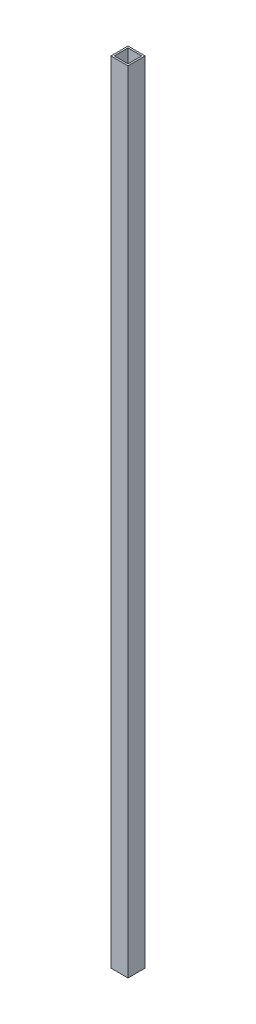
ISO-10303-21;
HEADER;
FILE_DESCRIPTION(('STEP AP214'),'2;1');
FILE_NAME('part.step','',(''),(''),'','','');
FILE_SCHEMA(('AUTOMOTIVE_DESIGN { 1 0 10303 214 1 1 1 1 }'));
ENDSEC;
DATA;
#1=APPLICATION_CONTEXT('core data for automotive mechanical design processes');
#2=APPLICATION_PROTOCOL_DEFINITION('international standard','automotive_design',2000,#1);
#3=PRODUCT_CONTEXT('',#1,'mechanical');
#4=PRODUCT('Part','Part','',(#3));
#5=PRODUCT_RELATED_PRODUCT_CATEGORY('part','',(#4));
#6=PRODUCT_DEFINITION_FORMATION('','',#4);
#7=PRODUCT_DEFINITION_CONTEXT('part definition',#1,'design');
#8=PRODUCT_DEFINITION('design','',#6,#7);
#9=PRODUCT_DEFINITION_SHAPE('','',#8);
#10=(LENGTH_UNIT() NAMED_UNIT(*) SI_UNIT(.MILLI.,.METRE.));
#11=(NAMED_UNIT(*) PLANE_ANGLE_UNIT() SI_UNIT($,.RADIAN.));
#12=(NAMED_UNIT(*) SI_UNIT($,.STERADIAN.) SOLID_ANGLE_UNIT());
#13=UNCERTAINTY_MEASURE_WITH_UNIT(LENGTH_MEASURE(1.E-05),#10,'distance_accuracy_value','');
#14=(GEOMETRIC_REPRESENTATION_CONTEXT(3) GLOBAL_UNCERTAINTY_ASSIGNED_CONTEXT((#13)) GLOBAL_UNIT_ASSIGNED_CONTEXT((#10,
#11,#12)) REPRESENTATION_CONTEXT('',''));
#15=CARTESIAN_POINT('',(0.,0.,0.));
#16=DIRECTION('',(0.,0.,1.));
#17=DIRECTION('',(1.,0.,0.));
#18=AXIS2_PLACEMENT_3D('',#15,#16,#17);
#19=CARTESIAN_POINT('',(-2.54,1168.4,2.54));
#20=DIRECTION('',(0.,0.,1.));
#21=DIRECTION('',(1.,0.,0.));
#22=AXIS2_PLACEMENT_3D('',#19,#20,#21);
#23=PLANE('',#22);
#24=DIRECTION('',(-1.,0.,0.));
#25=VECTOR('',#24,1.);
#26=CARTESIAN_POINT('',(-2.54,0.,2.54));
#27=LINE('',#26,#25);
#28=CARTESIAN_POINT('',(-2.54,0.,2.54));
#29=VERTEX_POINT('',#28);
#30=CARTESIAN_POINT('',(-22.86,0.,2.54));
#31=VERTEX_POINT('',#30);
#32=EDGE_CURVE('E170',#29,#31,#27,.T.);
#33=ORIENTED_EDGE('',*,*,#32,.F.);
#34=DIRECTION('',(0.,-1.,0.));
#35=VECTOR('',#34,1.);
#36=CARTESIAN_POINT('',(-2.54,1168.4,2.54));
#37=LINE('',#36,#35);
#38=CARTESIAN_POINT('',(-2.54,1168.4,2.54));
#39=VERTEX_POINT('',#38);
#40=EDGE_CURVE('E12',#39,#29,#37,.T.);
#41=ORIENTED_EDGE('',*,*,#40,.F.);
#42=DIRECTION('',(-1.,0.,0.));
#43=VECTOR('',#42,1.);
#44=CARTESIAN_POINT('',(-2.54,1168.4,2.54));
#45=LINE('',#44,#43);
#46=CARTESIAN_POINT('',(-22.86,1168.4,2.54));
#47=VERTEX_POINT('',#46);
#48=EDGE_CURVE('E145',#39,#47,#45,.T.);
#49=ORIENTED_EDGE('',*,*,#48,.T.);
#50=DIRECTION('',(0.,-1.,0.));
#51=VECTOR('',#50,1.);
#52=CARTESIAN_POINT('',(-22.86,1168.4,2.54));
#53=LINE('',#52,#51);
#54=EDGE_CURVE('E75',#47,#31,#53,.T.);
#55=ORIENTED_EDGE('',*,*,#54,.T.);
#56=EDGE_LOOP('',(#33,#41,#49,#55));
#57=FACE_BOUND('',#56,.T.);
#58=ADVANCED_FACE('F55',(#57),#23,.T.);
#59=CARTESIAN_POINT('',(-2.54,1168.4,2.54));
#60=DIRECTION('',(-1.,0.,0.));
#61=DIRECTION('',(0.,0.,1.));
#62=AXIS2_PLACEMENT_3D('',#59,#60,#61);
#63=PLANE('',#62);
#64=DIRECTION('',(0.,0.,-1.));
#65=VECTOR('',#64,1.);
#66=CARTESIAN_POINT('',(-2.54,0.,2.54));
#67=LINE('',#66,#65);
#68=CARTESIAN_POINT('',(-2.54,0.,22.86));
#69=VERTEX_POINT('',#68);
#70=EDGE_CURVE('E133',#69,#29,#67,.T.);
#71=ORIENTED_EDGE('',*,*,#70,.F.);
#72=DIRECTION('',(0.,-1.,0.));
#73=VECTOR('',#72,1.);
#74=CARTESIAN_POINT('',(-2.54,1168.4,22.86));
#75=LINE('',#74,#73);
#76=CARTESIAN_POINT('',(-2.54,1168.4,22.86));
#77=VERTEX_POINT('',#76);
#78=EDGE_CURVE('E66',#77,#69,#75,.T.);
#79=ORIENTED_EDGE('',*,*,#78,.F.);
#80=DIRECTION('',(0.,0.,-1.));
#81=VECTOR('',#80,1.);
#82=CARTESIAN_POINT('',(-2.54,1168.4,2.54));
#83=LINE('',#82,#81);
#84=EDGE_CURVE('E131',#77,#39,#83,.T.);
#85=ORIENTED_EDGE('',*,*,#84,.T.);
#86=ORIENTED_EDGE('',*,*,#40,.T.);
#87=EDGE_LOOP('',(#71,#79,#85,#86));
#88=FACE_BOUND('',#87,.T.);
#89=ADVANCED_FACE('F130',(#88),#63,.T.);
#90=CARTESIAN_POINT('',(-2.54,1168.4,22.86));
#91=DIRECTION('',(0.,0.,-1.));
#92=DIRECTION('',(-1.,0.,0.));
#93=AXIS2_PLACEMENT_3D('',#90,#91,#92);
#94=PLANE('',#93);
#95=DIRECTION('',(1.,0.,0.));
#96=VECTOR('',#95,1.);
#97=CARTESIAN_POINT('',(-2.54,0.,22.86));
#98=LINE('',#97,#96);
#99=CARTESIAN_POINT('',(-22.86,0.,22.86));
#100=VERTEX_POINT('',#99);
#101=EDGE_CURVE('E175',#100,#69,#98,.T.);
#102=ORIENTED_EDGE('',*,*,#101,.F.);
#103=DIRECTION('',(0.,-1.,0.));
#104=VECTOR('',#103,1.);
#105=CARTESIAN_POINT('',(-22.86,1168.4,22.86));
#106=LINE('',#105,#104);
#107=CARTESIAN_POINT('',(-22.86,1168.4,22.86));
#108=VERTEX_POINT('',#107);
#109=EDGE_CURVE('E100',#108,#100,#106,.T.);
#110=ORIENTED_EDGE('',*,*,#109,.F.);
#111=DIRECTION('',(1.,0.,0.));
#112=VECTOR('',#111,1.);
#113=CARTESIAN_POINT('',(-2.54,1168.4,22.86));
#114=LINE('',#113,#112);
#115=EDGE_CURVE('E144',#108,#77,#114,.T.);
#116=ORIENTED_EDGE('',*,*,#115,.T.);
#117=ORIENTED_EDGE('',*,*,#78,.T.);
#118=EDGE_LOOP('',(#102,#110,#116,#117));
#119=FACE_BOUND('',#118,.T.);
#120=ADVANCED_FACE('F148',(#119),#94,.T.);
#121=CARTESIAN_POINT('',(0.,1168.4,0.));
#122=DIRECTION('',(-1.,0.,0.));
#123=DIRECTION('',(0.,0.,1.));
#124=AXIS2_PLACEMENT_3D('',#121,#122,#123);
#125=PLANE('',#124);
#126=DIRECTION('',(0.,0.,-1.));
#127=VECTOR('',#126,1.);
#128=CARTESIAN_POINT('',(0.,0.,0.));
#129=LINE('',#128,#127);
#130=CARTESIAN_POINT('',(0.,0.,25.4));
#131=VERTEX_POINT('',#130);
#132=CARTESIAN_POINT('',(0.,0.,0.));
#133=VERTEX_POINT('',#132);
#134=EDGE_CURVE('E157',#131,#133,#129,.T.);
#135=ORIENTED_EDGE('',*,*,#134,.T.);
#136=DIRECTION('',(0.,-1.,0.));
#137=VECTOR('',#136,1.);
#138=CARTESIAN_POINT('',(0.,1168.4,0.));
#139=LINE('',#138,#137);
#140=CARTESIAN_POINT('',(0.,1168.4,0.));
#141=VERTEX_POINT('',#140);
#142=EDGE_CURVE('E59',#141,#133,#139,.T.);
#143=ORIENTED_EDGE('',*,*,#142,.F.);
#144=DIRECTION('',(0.,0.,-1.));
#145=VECTOR('',#144,1.);
#146=CARTESIAN_POINT('',(0.,1168.4,0.));
#147=LINE('',#146,#145);
#148=CARTESIAN_POINT('',(0.,1168.4,25.4));
#149=VERTEX_POINT('',#148);
#150=EDGE_CURVE('E182',#149,#141,#147,.T.);
#151=ORIENTED_EDGE('',*,*,#150,.F.);
#152=DIRECTION('',(0.,-1.,0.));
#153=VECTOR('',#152,1.);
#154=CARTESIAN_POINT('',(0.,1168.4,25.4));
#155=LINE('',#154,#153);
#156=EDGE_CURVE('E153',#149,#131,#155,.T.);
#157=ORIENTED_EDGE('',*,*,#156,.T.);
#158=EDGE_LOOP('',(#135,#143,#151,#157));
#159=FACE_BOUND('',#158,.T.);
#160=ADVANCED_FACE('F57',(#159),#125,.F.);
#161=CARTESIAN_POINT('',(0.,1168.4,0.));
#162=DIRECTION('',(0.,0.,1.));
#163=DIRECTION('',(1.,0.,0.));
#164=AXIS2_PLACEMENT_3D('',#161,#162,#163);
#165=PLANE('',#164);
#166=DIRECTION('',(-1.,0.,0.));
#167=VECTOR('',#166,1.);
#168=CARTESIAN_POINT('',(0.,0.,0.));
#169=LINE('',#168,#167);
#170=CARTESIAN_POINT('',(-25.4,0.,0.));
#171=VERTEX_POINT('',#170);
#172=EDGE_CURVE('E161',#133,#171,#169,.T.);
#173=ORIENTED_EDGE('',*,*,#172,.T.);
#174=DIRECTION('',(0.,-1.,0.));
#175=VECTOR('',#174,1.);
#176=CARTESIAN_POINT('',(-25.4,1168.4,0.));
#177=LINE('',#176,#175);
#178=CARTESIAN_POINT('',(-25.4,1168.4,0.));
#179=VERTEX_POINT('',#178);
#180=EDGE_CURVE('E193',#179,#171,#177,.T.);
#181=ORIENTED_EDGE('',*,*,#180,.F.);
#182=DIRECTION('',(-1.,0.,0.));
#183=VECTOR('',#182,1.);
#184=CARTESIAN_POINT('',(0.,1168.4,0.));
#185=LINE('',#184,#183);
#186=EDGE_CURVE('E113',#141,#179,#185,.T.);
#187=ORIENTED_EDGE('',*,*,#186,.F.);
#188=ORIENTED_EDGE('',*,*,#142,.T.);
#189=EDGE_LOOP('',(#173,#181,#187,#188));
#190=FACE_BOUND('',#189,.T.);
#191=ADVANCED_FACE('F201',(#190),#165,.F.);
#192=CARTESIAN_POINT('',(-25.4,1168.4,0.));
#193=DIRECTION('',(1.,0.,0.));
#194=DIRECTION('',(0.,0.,-1.));
#195=AXIS2_PLACEMENT_3D('',#192,#193,#194);
#196=PLANE('',#195);
#197=DIRECTION('',(0.,0.,1.));
#198=VECTOR('',#197,1.);
#199=CARTESIAN_POINT('',(-25.4,0.,0.));
#200=LINE('',#199,#198);
#201=CARTESIAN_POINT('',(-25.4,0.,25.4));
#202=VERTEX_POINT('',#201);
#203=EDGE_CURVE('E164',#171,#202,#200,.T.);
#204=ORIENTED_EDGE('',*,*,#203,.T.);
#205=DIRECTION('',(0.,-1.,0.));
#206=VECTOR('',#205,1.);
#207=CARTESIAN_POINT('',(-25.4,1168.4,25.4));
#208=LINE('',#207,#206);
#209=CARTESIAN_POINT('',(-25.4,1168.4,25.4));
#210=VERTEX_POINT('',#209);
#211=EDGE_CURVE('E190',#210,#202,#208,.T.);
#212=ORIENTED_EDGE('',*,*,#211,.F.);
#213=DIRECTION('',(0.,0.,1.));
#214=VECTOR('',#213,1.);
#215=CARTESIAN_POINT('',(-25.4,1168.4,0.));
#216=LINE('',#215,#214);
#217=EDGE_CURVE('E218',#179,#210,#216,.T.);
#218=ORIENTED_EDGE('',*,*,#217,.F.);
#219=ORIENTED_EDGE('',*,*,#180,.T.);
#220=EDGE_LOOP('',(#204,#212,#218,#219));
#221=FACE_BOUND('',#220,.T.);
#222=ADVANCED_FACE('F211',(#221),#196,.F.);
#223=CARTESIAN_POINT('',(0.,1168.4,25.4));
#224=DIRECTION('',(0.,0.,-1.));
#225=DIRECTION('',(-1.,0.,0.));
#226=AXIS2_PLACEMENT_3D('',#223,#224,#225);
#227=PLANE('',#226);
#228=DIRECTION('',(1.,0.,0.));
#229=VECTOR('',#228,1.);
#230=CARTESIAN_POINT('',(0.,0.,25.4));
#231=LINE('',#230,#229);
#232=EDGE_CURVE('E167',#202,#131,#231,.T.);
#233=ORIENTED_EDGE('',*,*,#232,.T.);
#234=ORIENTED_EDGE('',*,*,#156,.F.);
#235=DIRECTION('',(1.,0.,0.));
#236=VECTOR('',#235,1.);
#237=CARTESIAN_POINT('',(0.,1168.4,25.4));
#238=LINE('',#237,#236);
#239=EDGE_CURVE('E215',#210,#149,#238,.T.);
#240=ORIENTED_EDGE('',*,*,#239,.F.);
#241=ORIENTED_EDGE('',*,*,#211,.T.);
#242=EDGE_LOOP('',(#233,#234,#240,#241));
#243=FACE_BOUND('',#242,.T.);
#244=ADVANCED_FACE('F214',(#243),#227,.F.);
#245=CARTESIAN_POINT('',(-22.86,1168.4,2.54));
#246=DIRECTION('',(1.,0.,0.));
#247=DIRECTION('',(0.,0.,-1.));
#248=AXIS2_PLACEMENT_3D('',#245,#246,#247);
#249=PLANE('',#248);
#250=DIRECTION('',(0.,0.,1.));
#251=VECTOR('',#250,1.);
#252=CARTESIAN_POINT('',(-22.86,0.,2.54));
#253=LINE('',#252,#251);
#254=EDGE_CURVE('E178',#31,#100,#253,.T.);
#255=ORIENTED_EDGE('',*,*,#254,.F.);
#256=ORIENTED_EDGE('',*,*,#54,.F.);
#257=DIRECTION('',(0.,0.,1.));
#258=VECTOR('',#257,1.);
#259=CARTESIAN_POINT('',(-22.86,1168.4,2.54));
#260=LINE('',#259,#258);
#261=EDGE_CURVE('E150',#47,#108,#260,.T.);
#262=ORIENTED_EDGE('',*,*,#261,.T.);
#263=ORIENTED_EDGE('',*,*,#109,.T.);
#264=EDGE_LOOP('',(#255,#256,#262,#263));
#265=FACE_BOUND('',#264,.T.);
#266=ADVANCED_FACE('F228',(#265),#249,.T.);
#267=CARTESIAN_POINT('',(0.,1168.4,0.));
#268=DIRECTION('',(0.,-1.,0.));
#269=DIRECTION('',(0.,0.,-1.));
#270=AXIS2_PLACEMENT_3D('',#267,#268,#269);
#271=PLANE('',#270);
#272=ORIENTED_EDGE('',*,*,#150,.T.);
#273=ORIENTED_EDGE('',*,*,#186,.T.);
#274=ORIENTED_EDGE('',*,*,#217,.T.);
#275=ORIENTED_EDGE('',*,*,#239,.T.);
#276=EDGE_LOOP('',(#272,#273,#274,#275));
#277=FACE_BOUND('',#276,.T.);
#278=ORIENTED_EDGE('',*,*,#48,.F.);
#279=ORIENTED_EDGE('',*,*,#84,.F.);
#280=ORIENTED_EDGE('',*,*,#115,.F.);
#281=ORIENTED_EDGE('',*,*,#261,.F.);
#282=EDGE_LOOP('',(#278,#279,#280,#281));
#283=FACE_BOUND('',#282,.T.);
#284=ADVANCED_FACE('F142',(#277,#283),#271,.F.);
#285=CARTESIAN_POINT('',(0.,0.,0.));
#286=DIRECTION('',(0.,-1.,0.));
#287=DIRECTION('',(0.,0.,-1.));
#288=AXIS2_PLACEMENT_3D('',#285,#286,#287);
#289=PLANE('',#288);
#290=ORIENTED_EDGE('',*,*,#134,.F.);
#291=ORIENTED_EDGE('',*,*,#232,.F.);
#292=ORIENTED_EDGE('',*,*,#203,.F.);
#293=ORIENTED_EDGE('',*,*,#172,.F.);
#294=EDGE_LOOP('',(#290,#291,#292,#293));
#295=FACE_BOUND('',#294,.T.);
#296=ORIENTED_EDGE('',*,*,#32,.T.);
#297=ORIENTED_EDGE('',*,*,#254,.T.);
#298=ORIENTED_EDGE('',*,*,#101,.T.);
#299=ORIENTED_EDGE('',*,*,#70,.T.);
#300=EDGE_LOOP('',(#296,#297,#298,#299));
#301=FACE_BOUND('',#300,.T.);
#302=ADVANCED_FACE('F208',(#295,#301),#289,.T.);
#303=CLOSED_SHELL('',(#58,#89,#120,#160,#191,#222,#244,#266,#284,#302));
#304=MANIFOLD_SOLID_BREP('B2',#303);
#305=ADVANCED_BREP_SHAPE_REPRESENTATION('',(#18,#304),#14);
#306=SHAPE_DEFINITION_REPRESENTATION(#9,#305);
ENDSEC;
END-ISO-10303-21;
